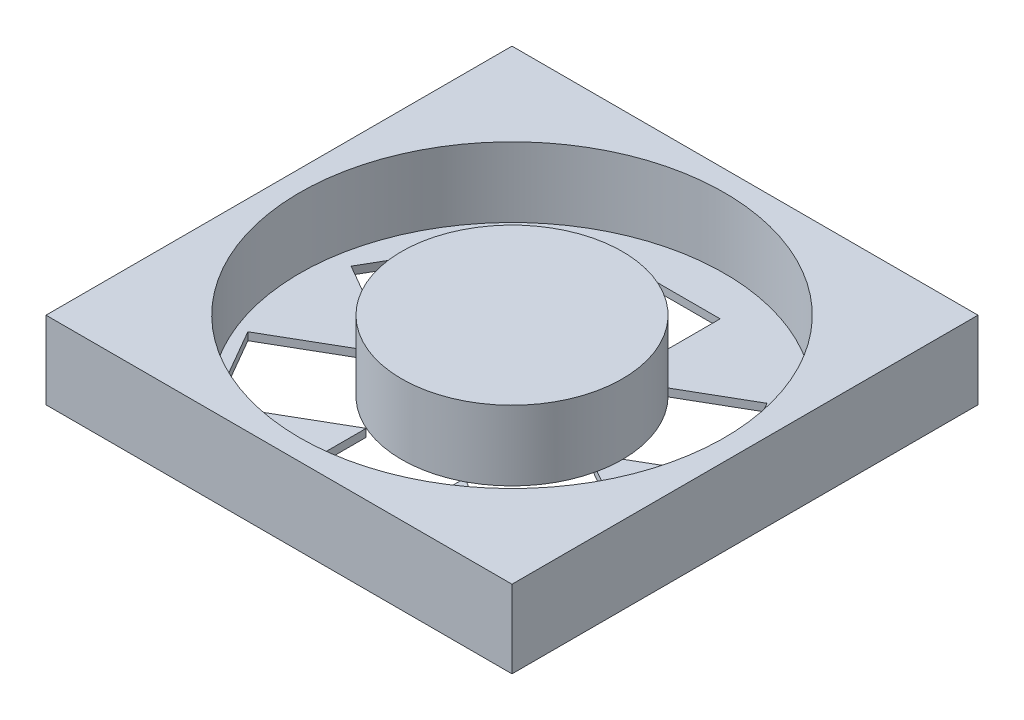
ISO-10303-21;
HEADER;
FILE_DESCRIPTION(('STEP AP214'),'2;1');
FILE_NAME('part.step','',(''),(''),'','','');
FILE_SCHEMA(('AUTOMOTIVE_DESIGN { 1 0 10303 214 1 1 1 1 }'));
ENDSEC;
DATA;
#1=APPLICATION_CONTEXT('core data for automotive mechanical design processes');
#2=APPLICATION_PROTOCOL_DEFINITION('international standard','automotive_design',2000,#1);
#3=PRODUCT_CONTEXT('',#1,'mechanical');
#4=PRODUCT('Part','Part','',(#3));
#5=PRODUCT_RELATED_PRODUCT_CATEGORY('part','',(#4));
#6=PRODUCT_DEFINITION_FORMATION('','',#4);
#7=PRODUCT_DEFINITION_CONTEXT('part definition',#1,'design');
#8=PRODUCT_DEFINITION('design','',#6,#7);
#9=PRODUCT_DEFINITION_SHAPE('','',#8);
#10=(LENGTH_UNIT() NAMED_UNIT(*) SI_UNIT(.MILLI.,.METRE.));
#11=(NAMED_UNIT(*) PLANE_ANGLE_UNIT() SI_UNIT($,.RADIAN.));
#12=(NAMED_UNIT(*) SI_UNIT($,.STERADIAN.) SOLID_ANGLE_UNIT());
#13=UNCERTAINTY_MEASURE_WITH_UNIT(LENGTH_MEASURE(1.E-05),#10,'distance_accuracy_value','');
#14=(GEOMETRIC_REPRESENTATION_CONTEXT(3) GLOBAL_UNCERTAINTY_ASSIGNED_CONTEXT((#13)) GLOBAL_UNIT_ASSIGNED_CONTEXT((#10,
#11,#12)) REPRESENTATION_CONTEXT('',''));
#15=CARTESIAN_POINT('',(0.,0.,0.));
#16=DIRECTION('',(0.,0.,1.));
#17=DIRECTION('',(1.,0.,0.));
#18=AXIS2_PLACEMENT_3D('',#15,#16,#17);
#19=CARTESIAN_POINT('',(-3.58333333333331,1.,23.));
#20=DIRECTION('',(0.,1.,0.));
#21=DIRECTION('',(0.,0.,1.));
#22=AXIS2_PLACEMENT_3D('',#19,#20,#21);
#23=PLANE('',#22);
#24=CARTESIAN_POINT('',(-3.58333333333331,1.,23.));
#25=DIRECTION('',(0.,1.,0.));
#26=DIRECTION('',(0.,0.,1.));
#27=AXIS2_PLACEMENT_3D('',#24,#25,#26);
#28=CIRCLE('',#27,27.3391290428055);
#29=CARTESIAN_POINT('',(-3.58333333333331,1.,50.3391290428055));
#30=VERTEX_POINT('',#29);
#31=EDGE_CURVE('E619',#30,#30,#28,.T.);
#32=ORIENTED_EDGE('',*,*,#31,.T.);
#33=EDGE_LOOP('',(#32));
#34=FACE_BOUND('',#33,.T.);
#35=DIRECTION('',(-0.499999999999992,0.,0.866025403784443));
#36=VECTOR('',#35,1.);
#37=CARTESIAN_POINT('',(-22.447766067007,1.,8.57036531274694));
#38=LINE('',#37,#36);
#39=CARTESIAN_POINT('',(-22.447766067007,1.,8.57036531274694));
#40=VERTEX_POINT('',#39);
#41=CARTESIAN_POINT('',(-28.4075248643401,1.,18.8929703505836));
#42=VERTEX_POINT('',#41);
#43=EDGE_CURVE('E535',#40,#42,#38,.T.);
#44=ORIENTED_EDGE('',*,*,#43,.F.);
#45=DIRECTION('',(0.866025403784443,0.,0.499999999999992));
#46=VECTOR('',#45,1.);
#47=CARTESIAN_POINT('',(-22.447766067007,1.,8.57036531274694));
#48=LINE('',#47,#46);
#49=CARTESIAN_POINT('',(-14.0674513079261,1.,13.408742294796));
#50=VERTEX_POINT('',#49);
#51=EDGE_CURVE('E545',#40,#50,#48,.T.);
#52=ORIENTED_EDGE('',*,*,#51,.T.);
#53=CARTESIAN_POINT('',(-3.58333333333331,1.,23.));
#54=DIRECTION('',(0.,1.,0.));
#55=DIRECTION('',(0.,0.,1.));
#56=AXIS2_PLACEMENT_3D('',#53,#54,#55);
#57=CIRCLE('',#56,14.2094670580151);
#58=CARTESIAN_POINT('',(-10.6904253750723,1.,10.6956025428684));
#59=VERTEX_POINT('',#58);
#60=EDGE_CURVE('E1033',#59,#50,#57,.T.);
#61=ORIENTED_EDGE('',*,*,#60,.F.);
#62=DIRECTION('',(0.,0.,1.));
#63=VECTOR('',#62,1.);
#64=CARTESIAN_POINT('',(-10.6904253750724,1.,1.00944614887827));
#65=LINE('',#64,#63);
#66=CARTESIAN_POINT('',(-10.6904253750724,1.,1.00944614887827));
#67=VERTEX_POINT('',#66);
#68=EDGE_CURVE('E568',#67,#59,#65,.T.);
#69=ORIENTED_EDGE('',*,*,#68,.F.);
#70=DIRECTION('',(-1.,0.,0.));
#71=VECTOR('',#70,1.);
#72=CARTESIAN_POINT('',(1.22909221959387,1.,1.00944614887819));
#73=LINE('',#72,#71);
#74=CARTESIAN_POINT('',(1.22909221959387,1.,1.00944614887819));
#75=VERTEX_POINT('',#74);
#76=EDGE_CURVE('E564',#75,#67,#73,.T.);
#77=ORIENTED_EDGE('',*,*,#76,.F.);
#78=DIRECTION('',(0.,0.,1.));
#79=VECTOR('',#78,1.);
#80=CARTESIAN_POINT('',(1.22909221959387,1.,1.00944614887819));
#81=LINE('',#80,#79);
#82=CARTESIAN_POINT('',(1.22909221959393,1.,9.63027620441062));
#83=VERTEX_POINT('',#82);
#84=EDGE_CURVE('E574',#75,#83,#81,.T.);
#85=ORIENTED_EDGE('',*,*,#84,.T.);
#86=CARTESIAN_POINT('',(5.53328145017321,1.,12.1006289648454));
#87=VERTEX_POINT('',#86);
#88=EDGE_CURVE('E1038',#87,#83,#57,.T.);
#89=ORIENTED_EDGE('',*,*,#88,.F.);
#90=DIRECTION('',(-0.866025403784436,0.,0.500000000000004));
#91=VECTOR('',#90,1.);
#92=CARTESIAN_POINT('',(13.6557106374321,1.,7.4111422871078));
#93=LINE('',#92,#91);
#94=CARTESIAN_POINT('',(13.6557106374321,1.,7.4111422871078));
#95=VERTEX_POINT('',#94);
#96=EDGE_CURVE('E424',#95,#87,#93,.T.);
#97=ORIENTED_EDGE('',*,*,#96,.F.);
#98=DIRECTION('',(-0.500000000000004,0.,-0.866025403784436));
#99=VECTOR('',#98,1.);
#100=CARTESIAN_POINT('',(19.6154694347652,1.,17.7337473249443));
#101=LINE('',#100,#99);
#102=CARTESIAN_POINT('',(19.6154694347652,1.,17.7337473249443));
#103=VERTEX_POINT('',#102);
#104=EDGE_CURVE('E403',#103,#95,#101,.T.);
#105=ORIENTED_EDGE('',*,*,#104,.F.);
#106=DIRECTION('',(-0.866025403784436,0.,0.500000000000004));
#107=VECTOR('',#106,1.);
#108=CARTESIAN_POINT('',(19.6154694347652,1.,17.7337473249443));
#109=LINE('',#108,#107);
#110=CARTESIAN_POINT('',(10.6259297315905,1.,22.9238604924632));
#111=VERTEX_POINT('',#110);
#112=EDGE_CURVE('E410',#103,#111,#109,.T.);
#113=ORIENTED_EDGE('',*,*,#112,.T.);
#114=CARTESIAN_POINT('',(10.3181979986245,1.,25.9421727854448));
#115=VERTEX_POINT('',#114);
#116=EDGE_CURVE('E1014',#115,#111,#57,.T.);
#117=ORIENTED_EDGE('',*,*,#116,.F.);
#118=DIRECTION('',(-0.86602540378444,0.,-0.499999999999998));
#119=VECTOR('',#118,1.);
#120=CARTESIAN_POINT('',(20.2847471606687,1.,31.6963626270426));
#121=LINE('',#120,#119);
#122=CARTESIAN_POINT('',(20.2847471606687,1.,31.6963626270426));
#123=VERTEX_POINT('',#122);
#124=EDGE_CURVE('E449',#123,#115,#121,.T.);
#125=ORIENTED_EDGE('',*,*,#124,.F.);
#126=DIRECTION('',(0.499999999999998,0.,-0.86602540378444));
#127=VECTOR('',#126,1.);
#128=CARTESIAN_POINT('',(14.3249883633356,1.,42.0189676648792));
#129=LINE('',#128,#127);
#130=CARTESIAN_POINT('',(14.3249883633356,1.,42.0189676648792));
#131=VERTEX_POINT('',#130);
#132=EDGE_CURVE('E444',#131,#123,#129,.T.);
#133=ORIENTED_EDGE('',*,*,#132,.F.);
#134=DIRECTION('',(-0.86602540378444,0.,-0.499999999999998));
#135=VECTOR('',#134,1.);
#136=CARTESIAN_POINT('',(14.3249883633356,1.,42.0189676648792));
#137=LINE('',#136,#135);
#138=CARTESIAN_POINT('',(3.10126080785786,1.,35.5389455394131));
#139=VERTEX_POINT('',#138);
#140=EDGE_CURVE('E456',#131,#139,#137,.T.);
#141=ORIENTED_EDGE('',*,*,#140,.T.);
#142=CARTESIAN_POINT('',(2.56764767140089,1.,35.8091524603392));
#143=VERTEX_POINT('',#142);
#144=EDGE_CURVE('E611',#143,#139,#57,.T.);
#145=ORIENTED_EDGE('',*,*,#144,.F.);
#146=DIRECTION('',(0.,0.,-1.));
#147=VECTOR('',#146,1.);
#148=CARTESIAN_POINT('',(2.56764767140089,1.,49.5798868287478));
#149=LINE('',#148,#147);
#150=CARTESIAN_POINT('',(2.56764767140089,1.,49.5798868287478));
#151=VERTEX_POINT('',#150);
#152=EDGE_CURVE('E481',#151,#143,#149,.T.);
#153=ORIENTED_EDGE('',*,*,#152,.F.);
#154=DIRECTION('',(1.,0.,0.));
#155=VECTOR('',#154,1.);
#156=CARTESIAN_POINT('',(-9.35186992326537,1.,49.5798868287478));
#157=LINE('',#156,#155);
#158=CARTESIAN_POINT('',(-9.35186992326537,1.,49.5798868287478));
#159=VERTEX_POINT('',#158);
#160=EDGE_CURVE('E477',#159,#151,#157,.T.);
#161=ORIENTED_EDGE('',*,*,#160,.F.);
#162=DIRECTION('',(0.,0.,-1.));
#163=VECTOR('',#162,1.);
#164=CARTESIAN_POINT('',(-9.35186992326537,1.,49.5798868287478));
#165=LINE('',#164,#163);
#166=CARTESIAN_POINT('',(-9.35186992326537,1.,36.0036792018627));
#167=VERTEX_POINT('',#166);
#168=EDGE_CURVE('E486',#159,#167,#165,.T.);
#169=ORIENTED_EDGE('',*,*,#168,.T.);
#170=DIRECTION('',(0.866025403784433,0.,-0.50000000000001));
#171=VECTOR('',#170,1.);
#172=CARTESIAN_POINT('',(-21.7784883411033,1.,43.1781906905183));
#173=LINE('',#172,#171);
#174=CARTESIAN_POINT('',(-21.7784883411033,1.,43.1781906905183));
#175=VERTEX_POINT('',#174);
#176=EDGE_CURVE('E506',#175,#167,#173,.T.);
#177=ORIENTED_EDGE('',*,*,#176,.F.);
#178=DIRECTION('',(0.50000000000001,0.,0.866025403784433));
#179=VECTOR('',#178,1.);
#180=CARTESIAN_POINT('',(-27.7382471384365,1.,32.8555856526818));
#181=LINE('',#180,#179);
#182=CARTESIAN_POINT('',(-27.7382471384365,1.,32.8555856526818));
#183=VERTEX_POINT('',#182);
#184=EDGE_CURVE('E504',#183,#175,#181,.T.);
#185=ORIENTED_EDGE('',*,*,#184,.F.);
#186=DIRECTION('',(0.866025403784433,0.,-0.50000000000001));
#187=VECTOR('',#186,1.);
#188=CARTESIAN_POINT('',(-27.7382471384365,1.,32.8555856526818));
#189=LINE('',#188,#187);
#190=CARTESIAN_POINT('',(-17.2717227885883,1.,26.812735001817));
#191=VERTEX_POINT('',#190);
#192=EDGE_CURVE('E514',#183,#191,#189,.T.);
#193=ORIENTED_EDGE('',*,*,#192,.T.);
#194=CARTESIAN_POINT('',(-17.6348831794101,1.,25.1125579272611));
#195=VERTEX_POINT('',#194);
#196=EDGE_CURVE('E1030',#195,#191,#57,.T.);
#197=ORIENTED_EDGE('',*,*,#196,.F.);
#198=DIRECTION('',(0.866025403784443,0.,0.499999999999992));
#199=VECTOR('',#198,1.);
#200=CARTESIAN_POINT('',(-28.4075248643401,1.,18.8929703505836));
#201=LINE('',#200,#199);
#202=EDGE_CURVE('E539',#42,#195,#201,.T.);
#203=ORIENTED_EDGE('',*,*,#202,.F.);
#204=EDGE_LOOP('',(#44,#52,#61,#69,#77,#85,#89,#97,#105,#113,#117,#125,#133,#141,#145,#153,#161,
#169,#177,#185,#193,#197,#203));
#205=FACE_BOUND('',#204,.T.);
#206=ADVANCED_FACE('F181',(#34,#205),#23,.T.);
#207=CARTESIAN_POINT('',(0.,0.,0.));
#208=DIRECTION('',(0.,1.,0.));
#209=DIRECTION('',(0.,0.,1.));
#210=AXIS2_PLACEMENT_3D('',#207,#208,#209);
#211=PLANE('',#210);
#212=DIRECTION('',(0.,0.,1.));
#213=VECTOR('',#212,1.);
#214=CARTESIAN_POINT('',(-33.5833333333333,0.,-7.));
#215=LINE('',#214,#213);
#216=CARTESIAN_POINT('',(-33.5833333333333,0.,-7.));
#217=VERTEX_POINT('',#216);
#218=CARTESIAN_POINT('',(-33.5833333333333,0.,53.));
#219=VERTEX_POINT('',#218);
#220=EDGE_CURVE('E622',#217,#219,#215,.T.);
#221=ORIENTED_EDGE('',*,*,#220,.F.);
#222=DIRECTION('',(-1.,0.,0.));
#223=VECTOR('',#222,1.);
#224=CARTESIAN_POINT('',(-33.5833333333333,0.,-7.));
#225=LINE('',#224,#223);
#226=CARTESIAN_POINT('',(26.4166666666667,0.,-7.));
#227=VERTEX_POINT('',#226);
#228=EDGE_CURVE('E629',#227,#217,#225,.T.);
#229=ORIENTED_EDGE('',*,*,#228,.F.);
#230=DIRECTION('',(0.,0.,-1.));
#231=VECTOR('',#230,1.);
#232=CARTESIAN_POINT('',(26.4166666666667,0.,-7.));
#233=LINE('',#232,#231);
#234=CARTESIAN_POINT('',(26.4166666666667,0.,53.));
#235=VERTEX_POINT('',#234);
#236=EDGE_CURVE('E640',#235,#227,#233,.T.);
#237=ORIENTED_EDGE('',*,*,#236,.F.);
#238=DIRECTION('',(1.,0.,0.));
#239=VECTOR('',#238,1.);
#240=CARTESIAN_POINT('',(-33.5833333333333,0.,53.));
#241=LINE('',#240,#239);
#242=EDGE_CURVE('E638',#219,#235,#241,.T.);
#243=ORIENTED_EDGE('',*,*,#242,.F.);
#244=EDGE_LOOP('',(#221,#229,#237,#243));
#245=FACE_BOUND('',#244,.T.);
#246=DIRECTION('',(-1.,0.,0.));
#247=VECTOR('',#246,1.);
#248=CARTESIAN_POINT('',(1.22909221959387,0.,1.00944614887819));
#249=LINE('',#248,#247);
#250=CARTESIAN_POINT('',(1.22909221959387,0.,1.00944614887819));
#251=VERTEX_POINT('',#250);
#252=CARTESIAN_POINT('',(-10.6904253750724,0.,1.00944614887827));
#253=VERTEX_POINT('',#252);
#254=EDGE_CURVE('E578',#251,#253,#249,.T.);
#255=ORIENTED_EDGE('',*,*,#254,.T.);
#256=DIRECTION('',(0.,0.,1.));
#257=VECTOR('',#256,1.);
#258=CARTESIAN_POINT('',(-10.6904253750724,0.,1.00944614887827));
#259=LINE('',#258,#257);
#260=CARTESIAN_POINT('',(-10.6904253750723,0.,15.3584691261895));
#261=VERTEX_POINT('',#260);
#262=EDGE_CURVE('E581',#253,#261,#259,.T.);
#263=ORIENTED_EDGE('',*,*,#262,.T.);
#264=DIRECTION('',(0.866025403784443,0.,0.499999999999992));
#265=VECTOR('',#264,1.);
#266=CARTESIAN_POINT('',(-22.447766067007,0.,8.57036531274694));
#267=LINE('',#266,#265);
#268=CARTESIAN_POINT('',(-22.447766067007,0.,8.57036531274694));
#269=VERTEX_POINT('',#268);
#270=EDGE_CURVE('E538',#269,#261,#267,.T.);
#271=ORIENTED_EDGE('',*,*,#270,.F.);
#272=DIRECTION('',(-0.499999999999992,0.,0.866025403784443));
#273=VECTOR('',#272,1.);
#274=CARTESIAN_POINT('',(-22.447766067007,0.,8.57036531274694));
#275=LINE('',#274,#273);
#276=CARTESIAN_POINT('',(-28.4075248643401,0.,18.8929703505836));
#277=VERTEX_POINT('',#276);
#278=EDGE_CURVE('E549',#269,#277,#275,.T.);
#279=ORIENTED_EDGE('',*,*,#278,.T.);
#280=DIRECTION('',(0.866025403784443,0.,0.499999999999992));
#281=VECTOR('',#280,1.);
#282=CARTESIAN_POINT('',(-28.4075248643401,0.,18.8929703505836));
#283=LINE('',#282,#281);
#284=CARTESIAN_POINT('',(-15.9809064465019,0.,26.0674818392391));
#285=VERTEX_POINT('',#284);
#286=EDGE_CURVE('E552',#277,#285,#283,.T.);
#287=ORIENTED_EDGE('',*,*,#286,.T.);
#288=DIRECTION('',(0.866025403784433,0.,-0.50000000000001));
#289=VECTOR('',#288,1.);
#290=CARTESIAN_POINT('',(-27.7382471384365,0.,32.8555856526818));
#291=LINE('',#290,#289);
#292=CARTESIAN_POINT('',(-27.7382471384365,0.,32.8555856526818));
#293=VERTEX_POINT('',#292);
#294=EDGE_CURVE('E507',#293,#285,#291,.T.);
#295=ORIENTED_EDGE('',*,*,#294,.F.);
#296=DIRECTION('',(0.50000000000001,0.,0.866025403784433));
#297=VECTOR('',#296,1.);
#298=CARTESIAN_POINT('',(-27.7382471384365,0.,32.8555856526818));
#299=LINE('',#298,#297);
#300=CARTESIAN_POINT('',(-21.7784883411033,0.,43.1781906905183));
#301=VERTEX_POINT('',#300);
#302=EDGE_CURVE('E518',#293,#301,#299,.T.);
#303=ORIENTED_EDGE('',*,*,#302,.T.);
#304=DIRECTION('',(0.866025403784433,0.,-0.50000000000001));
#305=VECTOR('',#304,1.);
#306=CARTESIAN_POINT('',(-21.7784883411033,0.,43.1781906905183));
#307=LINE('',#306,#305);
#308=CARTESIAN_POINT('',(-9.35186992326537,0.,36.0036792018627));
#309=VERTEX_POINT('',#308);
#310=EDGE_CURVE('E521',#301,#309,#307,.T.);
#311=ORIENTED_EDGE('',*,*,#310,.T.);
#312=DIRECTION('',(0.,0.,-1.));
#313=VECTOR('',#312,1.);
#314=CARTESIAN_POINT('',(-9.35186992326537,0.,49.5798868287478));
#315=LINE('',#314,#313);
#316=CARTESIAN_POINT('',(-9.35186992326537,0.,49.5798868287478));
#317=VERTEX_POINT('',#316);
#318=EDGE_CURVE('E480',#317,#309,#315,.T.);
#319=ORIENTED_EDGE('',*,*,#318,.F.);
#320=DIRECTION('',(1.,0.,0.));
#321=VECTOR('',#320,1.);
#322=CARTESIAN_POINT('',(-9.35186992326537,0.,49.5798868287478));
#323=LINE('',#322,#321);
#324=CARTESIAN_POINT('',(2.56764767140089,0.,49.5798868287478));
#325=VERTEX_POINT('',#324);
#326=EDGE_CURVE('E490',#317,#325,#323,.T.);
#327=ORIENTED_EDGE('',*,*,#326,.T.);
#328=DIRECTION('',(0.,0.,-1.));
#329=VECTOR('',#328,1.);
#330=CARTESIAN_POINT('',(2.56764767140089,0.,49.5798868287478));
#331=LINE('',#330,#329);
#332=CARTESIAN_POINT('',(2.56764767140089,0.,35.2308638514366));
#333=VERTEX_POINT('',#332);
#334=EDGE_CURVE('E493',#325,#333,#331,.T.);
#335=ORIENTED_EDGE('',*,*,#334,.T.);
#336=DIRECTION('',(-0.86602540378444,0.,-0.499999999999998));
#337=VECTOR('',#336,1.);
#338=CARTESIAN_POINT('',(14.3249883633356,0.,42.0189676648792));
#339=LINE('',#338,#337);
#340=CARTESIAN_POINT('',(14.3249883633356,0.,42.0189676648792));
#341=VERTEX_POINT('',#340);
#342=EDGE_CURVE('E448',#341,#333,#339,.T.);
#343=ORIENTED_EDGE('',*,*,#342,.F.);
#344=DIRECTION('',(0.499999999999998,0.,-0.86602540378444));
#345=VECTOR('',#344,1.);
#346=CARTESIAN_POINT('',(14.3249883633356,0.,42.0189676648792));
#347=LINE('',#346,#345);
#348=CARTESIAN_POINT('',(20.2847471606687,0.,31.6963626270426));
#349=VERTEX_POINT('',#348);
#350=EDGE_CURVE('E460',#341,#349,#347,.T.);
#351=ORIENTED_EDGE('',*,*,#350,.T.);
#352=DIRECTION('',(-0.86602540378444,0.,-0.499999999999998));
#353=VECTOR('',#352,1.);
#354=CARTESIAN_POINT('',(20.2847471606687,0.,31.6963626270426));
#355=LINE('',#354,#353);
#356=CARTESIAN_POINT('',(7.85812874283057,0.,24.521851138387));
#357=VERTEX_POINT('',#356);
#358=EDGE_CURVE('E463',#349,#357,#355,.T.);
#359=ORIENTED_EDGE('',*,*,#358,.T.);
#360=DIRECTION('',(-0.866025403784436,0.,0.500000000000004));
#361=VECTOR('',#360,1.);
#362=CARTESIAN_POINT('',(19.6154694347652,0.,17.7337473249443));
#363=LINE('',#362,#361);
#364=CARTESIAN_POINT('',(19.6154694347652,0.,17.7337473249443));
#365=VERTEX_POINT('',#364);
#366=EDGE_CURVE('E426',#365,#357,#363,.T.);
#367=ORIENTED_EDGE('',*,*,#366,.F.);
#368=DIRECTION('',(-0.500000000000004,0.,-0.866025403784436));
#369=VECTOR('',#368,1.);
#370=CARTESIAN_POINT('',(19.6154694347652,0.,17.7337473249443));
#371=LINE('',#370,#369);
#372=CARTESIAN_POINT('',(13.6557106374321,0.,7.4111422871078));
#373=VERTEX_POINT('',#372);
#374=EDGE_CURVE('E406',#365,#373,#371,.T.);
#375=ORIENTED_EDGE('',*,*,#374,.T.);
#376=DIRECTION('',(-0.866025403784436,0.,0.500000000000004));
#377=VECTOR('',#376,1.);
#378=CARTESIAN_POINT('',(13.6557106374321,0.,7.4111422871078));
#379=LINE('',#378,#377);
#380=CARTESIAN_POINT('',(1.22909221959397,0.,14.5856537757635));
#381=VERTEX_POINT('',#380);
#382=EDGE_CURVE('E436',#373,#381,#379,.T.);
#383=ORIENTED_EDGE('',*,*,#382,.T.);
#384=DIRECTION('',(0.,0.,1.));
#385=VECTOR('',#384,1.);
#386=CARTESIAN_POINT('',(1.22909221959387,0.,1.00944614887819));
#387=LINE('',#386,#385);
#388=EDGE_CURVE('E567',#251,#381,#387,.T.);
#389=ORIENTED_EDGE('',*,*,#388,.F.);
#390=EDGE_LOOP('',(#255,#263,#271,#279,#287,#295,#303,#311,#319,#327,#335,#343,#351,#359,#367,
#375,#383,#389));
#391=FACE_BOUND('',#390,.T.);
#392=ADVANCED_FACE('F658',(#245,#391),#211,.F.);
#393=CARTESIAN_POINT('',(-33.5833333333333,10.,-7.));
#394=DIRECTION('',(1.,0.,0.));
#395=DIRECTION('',(0.,0.,-1.));
#396=AXIS2_PLACEMENT_3D('',#393,#394,#395);
#397=PLANE('',#396);
#398=ORIENTED_EDGE('',*,*,#220,.T.);
#399=DIRECTION('',(0.,-1.,0.));
#400=VECTOR('',#399,1.);
#401=CARTESIAN_POINT('',(-33.5833333333333,10.,53.));
#402=LINE('',#401,#400);
#403=CARTESIAN_POINT('',(-33.5833333333333,10.,53.));
#404=VERTEX_POINT('',#403);
#405=EDGE_CURVE('E12',#404,#219,#402,.T.);
#406=ORIENTED_EDGE('',*,*,#405,.F.);
#407=DIRECTION('',(0.,0.,1.));
#408=VECTOR('',#407,1.);
#409=CARTESIAN_POINT('',(-33.5833333333333,10.,-7.));
#410=LINE('',#409,#408);
#411=CARTESIAN_POINT('',(-33.5833333333333,10.,-7.));
#412=VERTEX_POINT('',#411);
#413=EDGE_CURVE('E625',#412,#404,#410,.T.);
#414=ORIENTED_EDGE('',*,*,#413,.F.);
#415=DIRECTION('',(0.,-1.,0.));
#416=VECTOR('',#415,1.);
#417=CARTESIAN_POINT('',(-33.5833333333333,10.,-7.));
#418=LINE('',#417,#416);
#419=EDGE_CURVE('E635',#412,#217,#418,.T.);
#420=ORIENTED_EDGE('',*,*,#419,.T.);
#421=EDGE_LOOP('',(#398,#406,#414,#420));
#422=FACE_BOUND('',#421,.T.);
#423=ADVANCED_FACE('F183',(#422),#397,.F.);
#424=CARTESIAN_POINT('',(-33.5833333333333,10.,53.));
#425=DIRECTION('',(0.,0.,-1.));
#426=DIRECTION('',(-1.,0.,0.));
#427=AXIS2_PLACEMENT_3D('',#424,#425,#426);
#428=PLANE('',#427);
#429=ORIENTED_EDGE('',*,*,#242,.T.);
#430=DIRECTION('',(0.,-1.,0.));
#431=VECTOR('',#430,1.);
#432=CARTESIAN_POINT('',(26.4166666666667,10.,53.));
#433=LINE('',#432,#431);
#434=CARTESIAN_POINT('',(26.4166666666667,10.,53.));
#435=VERTEX_POINT('',#434);
#436=EDGE_CURVE('E189',#435,#235,#433,.T.);
#437=ORIENTED_EDGE('',*,*,#436,.F.);
#438=DIRECTION('',(1.,0.,0.));
#439=VECTOR('',#438,1.);
#440=CARTESIAN_POINT('',(-33.5833333333333,10.,53.));
#441=LINE('',#440,#439);
#442=EDGE_CURVE('E628',#404,#435,#441,.T.);
#443=ORIENTED_EDGE('',*,*,#442,.F.);
#444=ORIENTED_EDGE('',*,*,#405,.T.);
#445=EDGE_LOOP('',(#429,#437,#443,#444));
#446=FACE_BOUND('',#445,.T.);
#447=ADVANCED_FACE('F669',(#446),#428,.F.);
#448=CARTESIAN_POINT('',(26.4166666666667,10.,-7.));
#449=DIRECTION('',(-1.,0.,0.));
#450=DIRECTION('',(0.,0.,1.));
#451=AXIS2_PLACEMENT_3D('',#448,#449,#450);
#452=PLANE('',#451);
#453=ORIENTED_EDGE('',*,*,#236,.T.);
#454=DIRECTION('',(0.,-1.,0.));
#455=VECTOR('',#454,1.);
#456=CARTESIAN_POINT('',(26.4166666666667,10.,-7.));
#457=LINE('',#456,#455);
#458=CARTESIAN_POINT('',(26.4166666666667,10.,-7.));
#459=VERTEX_POINT('',#458);
#460=EDGE_CURVE('E645',#459,#227,#457,.T.);
#461=ORIENTED_EDGE('',*,*,#460,.F.);
#462=DIRECTION('',(0.,0.,-1.));
#463=VECTOR('',#462,1.);
#464=CARTESIAN_POINT('',(26.4166666666667,10.,-7.));
#465=LINE('',#464,#463);
#466=EDGE_CURVE('E631',#435,#459,#465,.T.);
#467=ORIENTED_EDGE('',*,*,#466,.F.);
#468=ORIENTED_EDGE('',*,*,#436,.T.);
#469=EDGE_LOOP('',(#453,#461,#467,#468));
#470=FACE_BOUND('',#469,.T.);
#471=ADVANCED_FACE('F652',(#470),#452,.F.);
#472=CARTESIAN_POINT('',(-33.5833333333333,10.,-7.));
#473=DIRECTION('',(0.,0.,1.));
#474=DIRECTION('',(1.,0.,0.));
#475=AXIS2_PLACEMENT_3D('',#472,#473,#474);
#476=PLANE('',#475);
#477=ORIENTED_EDGE('',*,*,#228,.T.);
#478=ORIENTED_EDGE('',*,*,#419,.F.);
#479=DIRECTION('',(-1.,0.,0.));
#480=VECTOR('',#479,1.);
#481=CARTESIAN_POINT('',(-33.5833333333333,10.,-7.));
#482=LINE('',#481,#480);
#483=EDGE_CURVE('E633',#459,#412,#482,.T.);
#484=ORIENTED_EDGE('',*,*,#483,.F.);
#485=ORIENTED_EDGE('',*,*,#460,.T.);
#486=EDGE_LOOP('',(#477,#478,#484,#485));
#487=FACE_BOUND('',#486,.T.);
#488=ADVANCED_FACE('F662',(#487),#476,.F.);
#489=CARTESIAN_POINT('',(0.,10.,0.));
#490=DIRECTION('',(0.,1.,0.));
#491=DIRECTION('',(0.,0.,1.));
#492=AXIS2_PLACEMENT_3D('',#489,#490,#491);
#493=PLANE('',#492);
#494=CARTESIAN_POINT('',(-3.58333333333331,10.,23.));
#495=DIRECTION('',(0.,1.,0.));
#496=DIRECTION('',(0.,0.,1.));
#497=AXIS2_PLACEMENT_3D('',#494,#495,#496);
#498=CIRCLE('',#497,27.3391290428055);
#499=CARTESIAN_POINT('',(-3.58333333333331,10.,50.3391290428055));
#500=VERTEX_POINT('',#499);
#501=EDGE_CURVE('E614',#500,#500,#498,.T.);
#502=ORIENTED_EDGE('',*,*,#501,.F.);
#503=EDGE_LOOP('',(#502));
#504=FACE_BOUND('',#503,.T.);
#505=ORIENTED_EDGE('',*,*,#413,.T.);
#506=ORIENTED_EDGE('',*,*,#442,.T.);
#507=ORIENTED_EDGE('',*,*,#466,.T.);
#508=ORIENTED_EDGE('',*,*,#483,.T.);
#509=EDGE_LOOP('',(#505,#506,#507,#508));
#510=FACE_BOUND('',#509,.T.);
#511=ADVANCED_FACE('F668',(#504,#510),#493,.T.);
#512=CARTESIAN_POINT('',(-3.58333333333331,1.,23.));
#513=DIRECTION('',(0.,1.,0.));
#514=DIRECTION('',(0.,0.,1.));
#515=AXIS2_PLACEMENT_3D('',#512,#513,#514);
#516=CYLINDRICAL_SURFACE('',#515,27.3391290428055);
#517=ORIENTED_EDGE('',*,*,#31,.F.);
#518=EDGE_LOOP('',(#517));
#519=FACE_BOUND('',#518,.T.);
#520=ORIENTED_EDGE('',*,*,#501,.T.);
#521=EDGE_LOOP('',(#520));
#522=FACE_BOUND('',#521,.T.);
#523=ADVANCED_FACE('F688',(#519,#522),#516,.F.);
#524=CARTESIAN_POINT('',(-3.58333333333331,1.,23.));
#525=DIRECTION('',(0.,1.,0.));
#526=DIRECTION('',(0.,0.,1.));
#527=AXIS2_PLACEMENT_3D('',#524,#525,#526);
#528=CYLINDRICAL_SURFACE('',#527,14.2094670580151);
#529=ORIENTED_EDGE('',*,*,#144,.T.);
#530=EDGE_CURVE('E615',#139,#115,#57,.T.);
#531=ORIENTED_EDGE('',*,*,#530,.T.);
#532=ORIENTED_EDGE('',*,*,#116,.T.);
#533=EDGE_CURVE('E1017',#111,#87,#57,.T.);
#534=ORIENTED_EDGE('',*,*,#533,.T.);
#535=ORIENTED_EDGE('',*,*,#88,.T.);
#536=EDGE_CURVE('E1035',#83,#59,#57,.T.);
#537=ORIENTED_EDGE('',*,*,#536,.T.);
#538=ORIENTED_EDGE('',*,*,#60,.T.);
#539=EDGE_CURVE('E1032',#50,#195,#57,.T.);
#540=ORIENTED_EDGE('',*,*,#539,.T.);
#541=ORIENTED_EDGE('',*,*,#196,.T.);
#542=EDGE_CURVE('E616',#191,#143,#57,.T.);
#543=ORIENTED_EDGE('',*,*,#542,.T.);
#544=EDGE_LOOP('',(#529,#531,#532,#534,#535,#537,#538,#540,#541,#543));
#545=FACE_BOUND('',#544,.T.);
#546=CARTESIAN_POINT('',(-3.58333333333331,10.,23.));
#547=DIRECTION('',(0.,1.,0.));
#548=DIRECTION('',(0.,0.,1.));
#549=AXIS2_PLACEMENT_3D('',#546,#547,#548);
#550=CIRCLE('',#549,14.2094670580151);
#551=CARTESIAN_POINT('',(-3.58333333333331,10.,37.2094670580151));
#552=VERTEX_POINT('',#551);
#553=EDGE_CURVE('E607',#552,#552,#550,.T.);
#554=ORIENTED_EDGE('',*,*,#553,.F.);
#555=EDGE_LOOP('',(#554));
#556=FACE_BOUND('',#555,.T.);
#557=ADVANCED_FACE('F686',(#545,#556),#528,.T.);
#558=ORIENTED_EDGE('',*,*,#553,.T.);
#559=EDGE_LOOP('',(#558));
#560=FACE_BOUND('',#559,.T.);
#561=ADVANCED_FACE('F694',(#560),#493,.T.);
#562=CARTESIAN_POINT('',(0.,1.,0.));
#563=DIRECTION('',(0.,1.,0.));
#564=DIRECTION('',(0.,0.,1.));
#565=AXIS2_PLACEMENT_3D('',#562,#563,#564);
#566=PLANE('',#565);
#567=DIRECTION('',(-0.499999999999992,0.,0.866025403784443));
#568=VECTOR('',#567,1.);
#569=CARTESIAN_POINT('',(-7.54347002307182,1.,17.1753646457946));
#570=LINE('',#569,#568);
#571=CARTESIAN_POINT('',(-8.14626998980301,1.,18.2194448149739));
#572=VERTEX_POINT('',#571);
#573=CARTESIAN_POINT('',(-12.2311511277702,1.,25.2946664888131));
#574=VERTEX_POINT('',#573);
#575=EDGE_CURVE('E541',#572,#574,#570,.T.);
#576=ORIENTED_EDGE('',*,*,#575,.T.);
#577=DIRECTION('',(0.50000000000001,0.,0.866025403784433));
#578=VECTOR('',#577,1.);
#579=CARTESIAN_POINT('',(-12.8339510945015,1.,24.2505863196338));
#580=LINE('',#579,#578);
#581=CARTESIAN_POINT('',(-8.1462699898029,1.,32.3698881626521));
#582=VERTEX_POINT('',#581);
#583=EDGE_CURVE('E510',#574,#582,#580,.T.);
#584=ORIENTED_EDGE('',*,*,#583,.T.);
#585=DIRECTION('',(1.,0.,0.));
#586=VECTOR('',#585,1.);
#587=CARTESIAN_POINT('',(-9.35186992326537,1.,32.3698881626521));
#588=LINE('',#587,#586);
#589=CARTESIAN_POINT('',(0.0234922861316353,1.,32.3698881626521));
#590=VERTEX_POINT('',#589);
#591=EDGE_CURVE('E483',#582,#590,#588,.T.);
#592=ORIENTED_EDGE('',*,*,#591,.T.);
#593=DIRECTION('',(0.499999999999998,0.,-0.86602540378444));
#594=VECTOR('',#593,1.);
#595=CARTESIAN_POINT('',(-0.579307680599564,1.,33.4139683318314));
#596=LINE('',#595,#594);
#597=CARTESIAN_POINT('',(4.10837342409892,1.,25.294666488813));
#598=VERTEX_POINT('',#597);
#599=EDGE_CURVE('E452',#590,#598,#596,.T.);
#600=ORIENTED_EDGE('',*,*,#599,.T.);
#601=DIRECTION('',(-0.500000000000004,0.,-0.866025403784436));
#602=VECTOR('',#601,1.);
#603=CARTESIAN_POINT('',(4.71117339083012,1.,26.3387466579922));
#604=LINE('',#603,#602);
#605=CARTESIAN_POINT('',(0.0234922861315897,1.,18.2194448149739));
#606=VERTEX_POINT('',#605);
#607=EDGE_CURVE('E432',#598,#606,#604,.T.);
#608=ORIENTED_EDGE('',*,*,#607,.T.);
#609=DIRECTION('',(-1.,0.,0.));
#610=VECTOR('',#609,1.);
#611=CARTESIAN_POINT('',(1.22909221959399,1.,18.2194448149739));
#612=LINE('',#611,#610);
#613=EDGE_CURVE('E571',#606,#572,#612,.T.);
#614=ORIENTED_EDGE('',*,*,#613,.T.);
#615=EDGE_LOOP('',(#576,#584,#592,#600,#608,#614));
#616=FACE_BOUND('',#615,.T.);
#617=CARTESIAN_POINT('',(2.56764767140089,1.,35.2308638514366));
#618=VERTEX_POINT('',#617);
#619=EDGE_CURVE('E455',#139,#618,#137,.T.);
#620=ORIENTED_EDGE('',*,*,#619,.T.);
#621=EDGE_CURVE('E479',#143,#618,#149,.T.);
#622=ORIENTED_EDGE('',*,*,#621,.F.);
#623=ORIENTED_EDGE('',*,*,#542,.F.);
#624=CARTESIAN_POINT('',(-15.9809064465019,1.,26.0674818392391));
#625=VERTEX_POINT('',#624);
#626=EDGE_CURVE('E513',#191,#625,#189,.T.);
#627=ORIENTED_EDGE('',*,*,#626,.T.);
#628=EDGE_CURVE('E537',#195,#625,#201,.T.);
#629=ORIENTED_EDGE('',*,*,#628,.F.);
#630=ORIENTED_EDGE('',*,*,#539,.F.);
#631=CARTESIAN_POINT('',(-10.6904253750723,1.,15.3584691261895));
#632=VERTEX_POINT('',#631);
#633=EDGE_CURVE('E544',#50,#632,#48,.T.);
#634=ORIENTED_EDGE('',*,*,#633,.T.);
#635=EDGE_CURVE('E566',#59,#632,#65,.T.);
#636=ORIENTED_EDGE('',*,*,#635,.F.);
#637=ORIENTED_EDGE('',*,*,#536,.F.);
#638=CARTESIAN_POINT('',(1.22909221959397,1.,14.5856537757635));
#639=VERTEX_POINT('',#638);
#640=EDGE_CURVE('E573',#83,#639,#81,.T.);
#641=ORIENTED_EDGE('',*,*,#640,.T.);
#642=EDGE_CURVE('E425',#87,#639,#93,.T.);
#643=ORIENTED_EDGE('',*,*,#642,.F.);
#644=ORIENTED_EDGE('',*,*,#533,.F.);
#645=CARTESIAN_POINT('',(7.85812874283057,1.,24.521851138387));
#646=VERTEX_POINT('',#645);
#647=EDGE_CURVE('E416',#111,#646,#109,.T.);
#648=ORIENTED_EDGE('',*,*,#647,.T.);
#649=EDGE_CURVE('E447',#115,#646,#121,.T.);
#650=ORIENTED_EDGE('',*,*,#649,.F.);
#651=ORIENTED_EDGE('',*,*,#530,.F.);
#652=EDGE_LOOP('',(#620,#622,#623,#627,#629,#630,#634,#636,#637,#641,#643,#644,#648,#650,#651));
#653=FACE_BOUND('',#652,.T.);
#654=ADVANCED_FACE('F726',(#616,#653),#566,.F.);
#655=CARTESIAN_POINT('',(19.6154694347652,1.,17.7337473249443));
#656=DIRECTION('',(0.500000000000004,0.,0.866025403784436));
#657=DIRECTION('',(0.866025403784436,0.,-0.500000000000004));
#658=AXIS2_PLACEMENT_3D('',#655,#656,#657);
#659=PLANE('',#658);
#660=ORIENTED_EDGE('',*,*,#112,.F.);
#661=DIRECTION('',(0.,-1.,0.));
#662=VECTOR('',#661,1.);
#663=CARTESIAN_POINT('',(19.6154694347652,1.,17.7337473249443));
#664=LINE('',#663,#662);
#665=EDGE_CURVE('E398',#103,#365,#664,.T.);
#666=ORIENTED_EDGE('',*,*,#665,.T.);
#667=ORIENTED_EDGE('',*,*,#366,.T.);
#668=DIRECTION('',(0.,-1.,0.));
#669=VECTOR('',#668,1.);
#670=CARTESIAN_POINT('',(7.85812874283056,1.,24.521851138387));
#671=LINE('',#670,#669);
#672=EDGE_CURVE('E443',#646,#357,#671,.T.);
#673=ORIENTED_EDGE('',*,*,#672,.F.);
#674=ORIENTED_EDGE('',*,*,#647,.F.);
#675=EDGE_LOOP('',(#660,#666,#667,#673,#674));
#676=FACE_BOUND('',#675,.T.);
#677=ADVANCED_FACE('F414',(#676),#659,.F.);
#678=CARTESIAN_POINT('',(19.6154694347652,1.,17.7337473249443));
#679=DIRECTION('',(-0.866025403784436,0.,0.500000000000004));
#680=DIRECTION('',(0.500000000000004,0.,0.866025403784436));
#681=AXIS2_PLACEMENT_3D('',#678,#679,#680);
#682=PLANE('',#681);
#683=ORIENTED_EDGE('',*,*,#374,.F.);
#684=ORIENTED_EDGE('',*,*,#665,.F.);
#685=ORIENTED_EDGE('',*,*,#104,.T.);
#686=DIRECTION('',(0.,-1.,0.));
#687=VECTOR('',#686,1.);
#688=CARTESIAN_POINT('',(13.6557106374321,1.,7.4111422871078));
#689=LINE('',#688,#687);
#690=EDGE_CURVE('E409',#95,#373,#689,.T.);
#691=ORIENTED_EDGE('',*,*,#690,.T.);
#692=EDGE_LOOP('',(#683,#684,#685,#691));
#693=FACE_BOUND('',#692,.T.);
#694=ADVANCED_FACE('F400',(#693),#682,.T.);
#695=CARTESIAN_POINT('',(13.6557106374321,1.,7.4111422871078));
#696=DIRECTION('',(0.500000000000004,0.,0.866025403784436));
#697=DIRECTION('',(0.866025403784436,0.,-0.500000000000004));
#698=AXIS2_PLACEMENT_3D('',#695,#696,#697);
#699=PLANE('',#698);
#700=ORIENTED_EDGE('',*,*,#382,.F.);
#701=ORIENTED_EDGE('',*,*,#690,.F.);
#702=ORIENTED_EDGE('',*,*,#96,.T.);
#703=ORIENTED_EDGE('',*,*,#642,.T.);
#704=DIRECTION('',(0.,1.,0.));
#705=VECTOR('',#704,1.);
#706=CARTESIAN_POINT('',(1.22909221959397,1.,14.5856537757635));
#707=LINE('',#706,#705);
#708=EDGE_CURVE('E604',#381,#639,#707,.T.);
#709=ORIENTED_EDGE('',*,*,#708,.F.);
#710=EDGE_LOOP('',(#700,#701,#702,#703,#709));
#711=FACE_BOUND('',#710,.T.);
#712=ADVANCED_FACE('F745',(#711),#699,.T.);
#713=CARTESIAN_POINT('',(4.71117339083012,1.,26.3387466579922));
#714=DIRECTION('',(-0.866025403784436,0.,0.500000000000004));
#715=DIRECTION('',(0.500000000000004,0.,0.866025403784437));
#716=AXIS2_PLACEMENT_3D('',#713,#714,#715);
#717=PLANE('',#716);
#718=DIRECTION('',(0.,-1.,0.));
#719=VECTOR('',#718,1.);
#720=CARTESIAN_POINT('',(4.10837342409892,1.,25.294666488813));
#721=LINE('',#720,#719);
#722=CARTESIAN_POINT('',(4.10837342409892,0.,25.294666488813));
#723=VERTEX_POINT('',#722);
#724=EDGE_CURVE('E603',#598,#723,#721,.T.);
#725=ORIENTED_EDGE('',*,*,#724,.T.);
#726=DIRECTION('',(-0.500000000000004,0.,-0.866025403784436));
#727=VECTOR('',#726,1.);
#728=CARTESIAN_POINT('',(4.71117339083012,0.,26.3387466579922));
#729=LINE('',#728,#727);
#730=CARTESIAN_POINT('',(0.0234922861315897,0.,18.2194448149739));
#731=VERTEX_POINT('',#730);
#732=EDGE_CURVE('E429',#723,#731,#729,.T.);
#733=ORIENTED_EDGE('',*,*,#732,.T.);
#734=DIRECTION('',(0.,1.,0.));
#735=VECTOR('',#734,1.);
#736=CARTESIAN_POINT('',(0.0234922861315906,1.,18.2194448149739));
#737=LINE('',#736,#735);
#738=EDGE_CURVE('E601',#731,#606,#737,.T.);
#739=ORIENTED_EDGE('',*,*,#738,.T.);
#740=ORIENTED_EDGE('',*,*,#607,.F.);
#741=EDGE_LOOP('',(#725,#733,#739,#740));
#742=FACE_BOUND('',#741,.T.);
#743=ADVANCED_FACE('F752',(#742),#717,.F.);
#744=CARTESIAN_POINT('',(-27.7382471384365,1.,32.8555856526818));
#745=DIRECTION('',(0.866025403784433,0.,-0.50000000000001));
#746=DIRECTION('',(-0.50000000000001,0.,-0.866025403784433));
#747=AXIS2_PLACEMENT_3D('',#744,#745,#746);
#748=PLANE('',#747);
#749=ORIENTED_EDGE('',*,*,#302,.F.);
#750=DIRECTION('',(0.,-1.,0.));
#751=VECTOR('',#750,1.);
#752=CARTESIAN_POINT('',(-27.7382471384365,1.,32.8555856526818));
#753=LINE('',#752,#751);
#754=EDGE_CURVE('E517',#183,#293,#753,.T.);
#755=ORIENTED_EDGE('',*,*,#754,.F.);
#756=ORIENTED_EDGE('',*,*,#184,.T.);
#757=DIRECTION('',(0.,-1.,0.));
#758=VECTOR('',#757,1.);
#759=CARTESIAN_POINT('',(-21.7784883411033,1.,43.1781906905183));
#760=LINE('',#759,#758);
#761=EDGE_CURVE('E531',#175,#301,#760,.T.);
#762=ORIENTED_EDGE('',*,*,#761,.T.);
#763=EDGE_LOOP('',(#749,#755,#756,#762));
#764=FACE_BOUND('',#763,.T.);
#765=ADVANCED_FACE('F760',(#764),#748,.T.);
#766=CARTESIAN_POINT('',(-21.7784883411033,1.,43.1781906905183));
#767=DIRECTION('',(-0.50000000000001,0.,-0.866025403784433));
#768=DIRECTION('',(-0.866025403784433,0.,0.50000000000001));
#769=AXIS2_PLACEMENT_3D('',#766,#767,#768);
#770=PLANE('',#769);
#771=DIRECTION('',(0.,-1.,0.));
#772=VECTOR('',#771,1.);
#773=CARTESIAN_POINT('',(-9.35186992326537,1.,36.0036792018627));
#774=LINE('',#773,#772);
#775=EDGE_CURVE('E503',#167,#309,#774,.T.);
#776=ORIENTED_EDGE('',*,*,#775,.T.);
#777=ORIENTED_EDGE('',*,*,#310,.F.);
#778=ORIENTED_EDGE('',*,*,#761,.F.);
#779=ORIENTED_EDGE('',*,*,#176,.T.);
#780=EDGE_LOOP('',(#776,#777,#778,#779));
#781=FACE_BOUND('',#780,.T.);
#782=ADVANCED_FACE('F768',(#781),#770,.T.);
#783=CARTESIAN_POINT('',(-27.7382471384365,1.,32.8555856526818));
#784=DIRECTION('',(-0.50000000000001,0.,-0.866025403784433));
#785=DIRECTION('',(-0.866025403784433,0.,0.50000000000001));
#786=AXIS2_PLACEMENT_3D('',#783,#784,#785);
#787=PLANE('',#786);
#788=ORIENTED_EDGE('',*,*,#192,.F.);
#789=ORIENTED_EDGE('',*,*,#754,.T.);
#790=ORIENTED_EDGE('',*,*,#294,.T.);
#791=DIRECTION('',(0.,-1.,0.));
#792=VECTOR('',#791,1.);
#793=CARTESIAN_POINT('',(-15.9809064465019,1.,26.0674818392391));
#794=LINE('',#793,#792);
#795=EDGE_CURVE('E534',#625,#285,#794,.T.);
#796=ORIENTED_EDGE('',*,*,#795,.F.);
#797=ORIENTED_EDGE('',*,*,#626,.F.);
#798=EDGE_LOOP('',(#788,#789,#790,#796,#797));
#799=FACE_BOUND('',#798,.T.);
#800=ADVANCED_FACE('F776',(#799),#787,.F.);
#801=CARTESIAN_POINT('',(-9.35186992326537,1.,49.5798868287478));
#802=DIRECTION('',(-1.,0.,0.));
#803=DIRECTION('',(0.,0.,1.));
#804=AXIS2_PLACEMENT_3D('',#801,#802,#803);
#805=PLANE('',#804);
#806=ORIENTED_EDGE('',*,*,#168,.F.);
#807=DIRECTION('',(0.,-1.,0.));
#808=VECTOR('',#807,1.);
#809=CARTESIAN_POINT('',(-9.35186992326537,1.,49.5798868287478));
#810=LINE('',#809,#808);
#811=EDGE_CURVE('E489',#159,#317,#810,.T.);
#812=ORIENTED_EDGE('',*,*,#811,.T.);
#813=ORIENTED_EDGE('',*,*,#318,.T.);
#814=ORIENTED_EDGE('',*,*,#775,.F.);
#815=EDGE_LOOP('',(#806,#812,#813,#814));
#816=FACE_BOUND('',#815,.T.);
#817=ADVANCED_FACE('F784',(#816),#805,.F.);
#818=CARTESIAN_POINT('',(-9.35186992326537,1.,49.5798868287478));
#819=DIRECTION('',(0.,0.,-1.));
#820=DIRECTION('',(-1.,0.,0.));
#821=AXIS2_PLACEMENT_3D('',#818,#819,#820);
#822=PLANE('',#821);
#823=ORIENTED_EDGE('',*,*,#326,.F.);
#824=ORIENTED_EDGE('',*,*,#811,.F.);
#825=ORIENTED_EDGE('',*,*,#160,.T.);
#826=DIRECTION('',(0.,-1.,0.));
#827=VECTOR('',#826,1.);
#828=CARTESIAN_POINT('',(2.56764767140089,1.,49.5798868287478));
#829=LINE('',#828,#827);
#830=EDGE_CURVE('E204',#151,#325,#829,.T.);
#831=ORIENTED_EDGE('',*,*,#830,.T.);
#832=EDGE_LOOP('',(#823,#824,#825,#831));
#833=FACE_BOUND('',#832,.T.);
#834=ADVANCED_FACE('F792',(#833),#822,.T.);
#835=CARTESIAN_POINT('',(-22.447766067007,1.,8.57036531274694));
#836=DIRECTION('',(0.866025403784443,0.,0.499999999999992));
#837=DIRECTION('',(0.499999999999992,0.,-0.866025403784443));
#838=AXIS2_PLACEMENT_3D('',#835,#836,#837);
#839=PLANE('',#838);
#840=ORIENTED_EDGE('',*,*,#278,.F.);
#841=DIRECTION('',(0.,-1.,0.));
#842=VECTOR('',#841,1.);
#843=CARTESIAN_POINT('',(-22.447766067007,1.,8.57036531274694));
#844=LINE('',#843,#842);
#845=EDGE_CURVE('E548',#40,#269,#844,.T.);
#846=ORIENTED_EDGE('',*,*,#845,.F.);
#847=ORIENTED_EDGE('',*,*,#43,.T.);
#848=DIRECTION('',(0.,-1.,0.));
#849=VECTOR('',#848,1.);
#850=CARTESIAN_POINT('',(-28.4075248643401,1.,18.8929703505836));
#851=LINE('',#850,#849);
#852=EDGE_CURVE('E196',#42,#277,#851,.T.);
#853=ORIENTED_EDGE('',*,*,#852,.T.);
#854=EDGE_LOOP('',(#840,#846,#847,#853));
#855=FACE_BOUND('',#854,.T.);
#856=ADVANCED_FACE('F800',(#855),#839,.T.);
#857=CARTESIAN_POINT('',(-28.4075248643401,1.,18.8929703505836));
#858=DIRECTION('',(0.499999999999992,0.,-0.866025403784443));
#859=DIRECTION('',(-0.866025403784443,0.,-0.499999999999992));
#860=AXIS2_PLACEMENT_3D('',#857,#858,#859);
#861=PLANE('',#860);
#862=ORIENTED_EDGE('',*,*,#795,.T.);
#863=ORIENTED_EDGE('',*,*,#286,.F.);
#864=ORIENTED_EDGE('',*,*,#852,.F.);
#865=ORIENTED_EDGE('',*,*,#202,.T.);
#866=ORIENTED_EDGE('',*,*,#628,.T.);
#867=EDGE_LOOP('',(#862,#863,#864,#865,#866));
#868=FACE_BOUND('',#867,.T.);
#869=ADVANCED_FACE('F808',(#868),#861,.T.);
#870=CARTESIAN_POINT('',(-12.8339510945015,1.,24.2505863196338));
#871=DIRECTION('',(0.866025403784433,0.,-0.50000000000001));
#872=DIRECTION('',(-0.50000000000001,0.,-0.866025403784433));
#873=AXIS2_PLACEMENT_3D('',#870,#871,#872);
#874=PLANE('',#873);
#875=ORIENTED_EDGE('',*,*,#583,.F.);
#876=DIRECTION('',(0.,-1.,0.));
#877=VECTOR('',#876,1.);
#878=CARTESIAN_POINT('',(-12.2311511277702,1.,25.2946664888131));
#879=LINE('',#878,#877);
#880=CARTESIAN_POINT('',(-12.2311511277702,0.,25.2946664888131));
#881=VERTEX_POINT('',#880);
#882=EDGE_CURVE('E494',#574,#881,#879,.T.);
#883=ORIENTED_EDGE('',*,*,#882,.T.);
#884=DIRECTION('',(0.50000000000001,0.,0.866025403784433));
#885=VECTOR('',#884,1.);
#886=CARTESIAN_POINT('',(-12.8339510945015,0.,24.2505863196338));
#887=LINE('',#886,#885);
#888=CARTESIAN_POINT('',(-8.1462699898029,0.,32.3698881626521));
#889=VERTEX_POINT('',#888);
#890=EDGE_CURVE('E525',#881,#889,#887,.T.);
#891=ORIENTED_EDGE('',*,*,#890,.T.);
#892=DIRECTION('',(0.,-1.,0.));
#893=VECTOR('',#892,1.);
#894=CARTESIAN_POINT('',(-8.1462699898029,1.,32.3698881626521));
#895=LINE('',#894,#893);
#896=EDGE_CURVE('E464',#582,#889,#895,.T.);
#897=ORIENTED_EDGE('',*,*,#896,.F.);
#898=EDGE_LOOP('',(#875,#883,#891,#897));
#899=FACE_BOUND('',#898,.T.);
#900=ADVANCED_FACE('F816',(#899),#874,.F.);
#901=CARTESIAN_POINT('',(-22.447766067007,1.,8.57036531274694));
#902=DIRECTION('',(0.499999999999992,0.,-0.866025403784443));
#903=DIRECTION('',(-0.866025403784443,0.,-0.499999999999992));
#904=AXIS2_PLACEMENT_3D('',#901,#902,#903);
#905=PLANE('',#904);
#906=ORIENTED_EDGE('',*,*,#51,.F.);
#907=ORIENTED_EDGE('',*,*,#845,.T.);
#908=ORIENTED_EDGE('',*,*,#270,.T.);
#909=DIRECTION('',(0.,-1.,0.));
#910=VECTOR('',#909,1.);
#911=CARTESIAN_POINT('',(-10.6904253750723,1.,15.3584691261895));
#912=LINE('',#911,#910);
#913=EDGE_CURVE('E563',#632,#261,#912,.T.);
#914=ORIENTED_EDGE('',*,*,#913,.F.);
#915=ORIENTED_EDGE('',*,*,#633,.F.);
#916=EDGE_LOOP('',(#906,#907,#908,#914,#915));
#917=FACE_BOUND('',#916,.T.);
#918=ADVANCED_FACE('F823',(#917),#905,.F.);
#919=CARTESIAN_POINT('',(-7.54347002307182,1.,17.1753646457946));
#920=DIRECTION('',(0.866025403784443,0.,0.499999999999992));
#921=DIRECTION('',(0.499999999999992,0.,-0.866025403784443));
#922=AXIS2_PLACEMENT_3D('',#919,#920,#921);
#923=PLANE('',#922);
#924=ORIENTED_EDGE('',*,*,#575,.F.);
#925=DIRECTION('',(0.,-1.,0.));
#926=VECTOR('',#925,1.);
#927=CARTESIAN_POINT('',(-8.14626998980301,1.,18.2194448149739));
#928=LINE('',#927,#926);
#929=CARTESIAN_POINT('',(-8.14626998980301,0.,18.2194448149739));
#930=VERTEX_POINT('',#929);
#931=EDGE_CURVE('E522',#572,#930,#928,.T.);
#932=ORIENTED_EDGE('',*,*,#931,.T.);
#933=DIRECTION('',(-0.499999999999992,0.,0.866025403784443));
#934=VECTOR('',#933,1.);
#935=CARTESIAN_POINT('',(-7.54347002307182,0.,17.1753646457946));
#936=LINE('',#935,#934);
#937=EDGE_CURVE('E556',#930,#881,#936,.T.);
#938=ORIENTED_EDGE('',*,*,#937,.T.);
#939=ORIENTED_EDGE('',*,*,#882,.F.);
#940=EDGE_LOOP('',(#924,#932,#938,#939));
#941=FACE_BOUND('',#940,.T.);
#942=ADVANCED_FACE('F831',(#941),#923,.F.);
#943=CARTESIAN_POINT('',(1.22909221959387,1.,1.00944614887819));
#944=DIRECTION('',(1.,0.,0.));
#945=DIRECTION('',(0.,0.,-1.));
#946=AXIS2_PLACEMENT_3D('',#943,#944,#945);
#947=PLANE('',#946);
#948=ORIENTED_EDGE('',*,*,#708,.T.);
#949=ORIENTED_EDGE('',*,*,#640,.F.);
#950=ORIENTED_EDGE('',*,*,#84,.F.);
#951=DIRECTION('',(0.,-1.,0.));
#952=VECTOR('',#951,1.);
#953=CARTESIAN_POINT('',(1.22909221959387,1.,1.00944614887819));
#954=LINE('',#953,#952);
#955=EDGE_CURVE('E577',#75,#251,#954,.T.);
#956=ORIENTED_EDGE('',*,*,#955,.T.);
#957=ORIENTED_EDGE('',*,*,#388,.T.);
#958=EDGE_LOOP('',(#948,#949,#950,#956,#957));
#959=FACE_BOUND('',#958,.T.);
#960=ADVANCED_FACE('F839',(#959),#947,.F.);
#961=CARTESIAN_POINT('',(1.22909221959387,1.,1.00944614887819));
#962=DIRECTION('',(0.,0.,1.));
#963=DIRECTION('',(1.,0.,0.));
#964=AXIS2_PLACEMENT_3D('',#961,#962,#963);
#965=PLANE('',#964);
#966=ORIENTED_EDGE('',*,*,#254,.F.);
#967=ORIENTED_EDGE('',*,*,#955,.F.);
#968=ORIENTED_EDGE('',*,*,#76,.T.);
#969=DIRECTION('',(0.,-1.,0.));
#970=VECTOR('',#969,1.);
#971=CARTESIAN_POINT('',(-10.6904253750724,1.,1.00944614887827));
#972=LINE('',#971,#970);
#973=EDGE_CURVE('E553',#67,#253,#972,.T.);
#974=ORIENTED_EDGE('',*,*,#973,.T.);
#975=EDGE_LOOP('',(#966,#967,#968,#974));
#976=FACE_BOUND('',#975,.T.);
#977=ADVANCED_FACE('F847',(#976),#965,.T.);
#978=CARTESIAN_POINT('',(-10.6904253750724,1.,1.00944614887827));
#979=DIRECTION('',(1.,0.,0.));
#980=DIRECTION('',(0.,0.,-1.));
#981=AXIS2_PLACEMENT_3D('',#978,#979,#980);
#982=PLANE('',#981);
#983=ORIENTED_EDGE('',*,*,#913,.T.);
#984=ORIENTED_EDGE('',*,*,#262,.F.);
#985=ORIENTED_EDGE('',*,*,#973,.F.);
#986=ORIENTED_EDGE('',*,*,#68,.T.);
#987=ORIENTED_EDGE('',*,*,#635,.T.);
#988=EDGE_LOOP('',(#983,#984,#985,#986,#987));
#989=FACE_BOUND('',#988,.T.);
#990=ADVANCED_FACE('F855',(#989),#982,.T.);
#991=CARTESIAN_POINT('',(1.22909221959399,1.,18.2194448149739));
#992=DIRECTION('',(0.,0.,1.));
#993=DIRECTION('',(1.,0.,0.));
#994=AXIS2_PLACEMENT_3D('',#991,#992,#993);
#995=PLANE('',#994);
#996=DIRECTION('',(-1.,0.,0.));
#997=VECTOR('',#996,1.);
#998=CARTESIAN_POINT('',(1.22909221959399,0.,18.2194448149739));
#999=LINE('',#998,#997);
#1000=EDGE_CURVE('E584',#731,#930,#999,.T.);
#1001=ORIENTED_EDGE('',*,*,#1000,.T.);
#1002=ORIENTED_EDGE('',*,*,#931,.F.);
#1003=ORIENTED_EDGE('',*,*,#613,.F.);
#1004=ORIENTED_EDGE('',*,*,#738,.F.);
#1005=EDGE_LOOP('',(#1001,#1002,#1003,#1004));
#1006=FACE_BOUND('',#1005,.T.);
#1007=ADVANCED_FACE('F862',(#1006),#995,.F.);
#1008=CARTESIAN_POINT('',(2.56764767140089,1.,49.5798868287478));
#1009=DIRECTION('',(-1.,0.,0.));
#1010=DIRECTION('',(0.,0.,1.));
#1011=AXIS2_PLACEMENT_3D('',#1008,#1009,#1010);
#1012=PLANE('',#1011);
#1013=DIRECTION('',(0.,-1.,0.));
#1014=VECTOR('',#1013,1.);
#1015=CARTESIAN_POINT('',(2.56764767140089,1.,35.2308638514366));
#1016=LINE('',#1015,#1014);
#1017=EDGE_CURVE('E476',#618,#333,#1016,.T.);
#1018=ORIENTED_EDGE('',*,*,#1017,.T.);
#1019=ORIENTED_EDGE('',*,*,#334,.F.);
#1020=ORIENTED_EDGE('',*,*,#830,.F.);
#1021=ORIENTED_EDGE('',*,*,#152,.T.);
#1022=ORIENTED_EDGE('',*,*,#621,.T.);
#1023=EDGE_LOOP('',(#1018,#1019,#1020,#1021,#1022));
#1024=FACE_BOUND('',#1023,.T.);
#1025=ADVANCED_FACE('F870',(#1024),#1012,.T.);
#1026=CARTESIAN_POINT('',(-9.35186992326537,1.,32.3698881626521));
#1027=DIRECTION('',(0.,0.,-1.));
#1028=DIRECTION('',(-1.,0.,0.));
#1029=AXIS2_PLACEMENT_3D('',#1026,#1027,#1028);
#1030=PLANE('',#1029);
#1031=ORIENTED_EDGE('',*,*,#591,.F.);
#1032=ORIENTED_EDGE('',*,*,#896,.T.);
#1033=DIRECTION('',(1.,0.,0.));
#1034=VECTOR('',#1033,1.);
#1035=CARTESIAN_POINT('',(-9.35186992326537,0.,32.3698881626521));
#1036=LINE('',#1035,#1034);
#1037=CARTESIAN_POINT('',(0.023492286131634,0.,32.3698881626521));
#1038=VERTEX_POINT('',#1037);
#1039=EDGE_CURVE('E497',#889,#1038,#1036,.T.);
#1040=ORIENTED_EDGE('',*,*,#1039,.T.);
#1041=DIRECTION('',(0.,-1.,0.));
#1042=VECTOR('',#1041,1.);
#1043=CARTESIAN_POINT('',(0.0234922861316351,1.,32.3698881626521));
#1044=LINE('',#1043,#1042);
#1045=EDGE_CURVE('E437',#590,#1038,#1044,.T.);
#1046=ORIENTED_EDGE('',*,*,#1045,.F.);
#1047=EDGE_LOOP('',(#1031,#1032,#1040,#1046));
#1048=FACE_BOUND('',#1047,.T.);
#1049=ADVANCED_FACE('F878',(#1048),#1030,.F.);
#1050=CARTESIAN_POINT('',(-0.579307680599564,1.,33.4139683318314));
#1051=DIRECTION('',(-0.86602540378444,0.,-0.499999999999998));
#1052=DIRECTION('',(-0.499999999999998,0.,0.86602540378444));
#1053=AXIS2_PLACEMENT_3D('',#1050,#1051,#1052);
#1054=PLANE('',#1053);
#1055=ORIENTED_EDGE('',*,*,#599,.F.);
#1056=ORIENTED_EDGE('',*,*,#1045,.T.);
#1057=DIRECTION('',(0.499999999999998,0.,-0.86602540378444));
#1058=VECTOR('',#1057,1.);
#1059=CARTESIAN_POINT('',(-0.579307680599564,0.,33.4139683318314));
#1060=LINE('',#1059,#1058);
#1061=EDGE_CURVE('E467',#1038,#723,#1060,.T.);
#1062=ORIENTED_EDGE('',*,*,#1061,.T.);
#1063=ORIENTED_EDGE('',*,*,#724,.F.);
#1064=EDGE_LOOP('',(#1055,#1056,#1062,#1063));
#1065=FACE_BOUND('',#1064,.T.);
#1066=ADVANCED_FACE('F885',(#1065),#1054,.F.);
#1067=CARTESIAN_POINT('',(14.3249883633356,1.,42.0189676648792));
#1068=DIRECTION('',(-0.499999999999998,0.,0.86602540378444));
#1069=DIRECTION('',(0.86602540378444,0.,0.499999999999998));
#1070=AXIS2_PLACEMENT_3D('',#1067,#1068,#1069);
#1071=PLANE('',#1070);
#1072=ORIENTED_EDGE('',*,*,#140,.F.);
#1073=DIRECTION('',(0.,-1.,0.));
#1074=VECTOR('',#1073,1.);
#1075=CARTESIAN_POINT('',(14.3249883633356,1.,42.0189676648792));
#1076=LINE('',#1075,#1074);
#1077=EDGE_CURVE('E459',#131,#341,#1076,.T.);
#1078=ORIENTED_EDGE('',*,*,#1077,.T.);
#1079=ORIENTED_EDGE('',*,*,#342,.T.);
#1080=ORIENTED_EDGE('',*,*,#1017,.F.);
#1081=ORIENTED_EDGE('',*,*,#619,.F.);
#1082=EDGE_LOOP('',(#1072,#1078,#1079,#1080,#1081));
#1083=FACE_BOUND('',#1082,.T.);
#1084=ADVANCED_FACE('F893',(#1083),#1071,.F.);
#1085=CARTESIAN_POINT('',(14.3249883633356,1.,42.0189676648792));
#1086=DIRECTION('',(-0.86602540378444,0.,-0.499999999999998));
#1087=DIRECTION('',(-0.499999999999998,0.,0.86602540378444));
#1088=AXIS2_PLACEMENT_3D('',#1085,#1086,#1087);
#1089=PLANE('',#1088);
#1090=ORIENTED_EDGE('',*,*,#350,.F.);
#1091=ORIENTED_EDGE('',*,*,#1077,.F.);
#1092=ORIENTED_EDGE('',*,*,#132,.T.);
#1093=DIRECTION('',(0.,-1.,0.));
#1094=VECTOR('',#1093,1.);
#1095=CARTESIAN_POINT('',(20.2847471606687,1.,31.6963626270426));
#1096=LINE('',#1095,#1094);
#1097=EDGE_CURVE('E473',#123,#349,#1096,.T.);
#1098=ORIENTED_EDGE('',*,*,#1097,.T.);
#1099=EDGE_LOOP('',(#1090,#1091,#1092,#1098));
#1100=FACE_BOUND('',#1099,.T.);
#1101=ADVANCED_FACE('F901',(#1100),#1089,.T.);
#1102=CARTESIAN_POINT('',(20.2847471606687,1.,31.6963626270426));
#1103=DIRECTION('',(-0.499999999999998,0.,0.86602540378444));
#1104=DIRECTION('',(0.86602540378444,0.,0.499999999999998));
#1105=AXIS2_PLACEMENT_3D('',#1102,#1103,#1104);
#1106=PLANE('',#1105);
#1107=ORIENTED_EDGE('',*,*,#672,.T.);
#1108=ORIENTED_EDGE('',*,*,#358,.F.);
#1109=ORIENTED_EDGE('',*,*,#1097,.F.);
#1110=ORIENTED_EDGE('',*,*,#124,.T.);
#1111=ORIENTED_EDGE('',*,*,#649,.T.);
#1112=EDGE_LOOP('',(#1107,#1108,#1109,#1110,#1111));
#1113=FACE_BOUND('',#1112,.T.);
#1114=ADVANCED_FACE('F697',(#1113),#1106,.T.);
#1115=ORIENTED_EDGE('',*,*,#890,.F.);
#1116=ORIENTED_EDGE('',*,*,#937,.F.);
#1117=ORIENTED_EDGE('',*,*,#1000,.F.);
#1118=ORIENTED_EDGE('',*,*,#732,.F.);
#1119=ORIENTED_EDGE('',*,*,#1061,.F.);
#1120=ORIENTED_EDGE('',*,*,#1039,.F.);
#1121=EDGE_LOOP('',(#1115,#1116,#1117,#1118,#1119,#1120));
#1122=FACE_BOUND('',#1121,.T.);
#1123=ADVANCED_FACE('F683',(#1122),#211,.F.);
#1124=CLOSED_SHELL('',(#206,#392,#423,#447,#471,#488,#511,#523,#557,#561,#654,#677,#694,#712,
#743,#765,#782,#800,#817,#834,#856,#869,#900,#918,#942,#960,#977,#990,#1007,#1025,#1049,#1066,
#1084,#1101,#1114,#1123));
#1125=MANIFOLD_SOLID_BREP('B2',#1124);
#1126=ADVANCED_BREP_SHAPE_REPRESENTATION('',(#18,#1125),#14);
#1127=SHAPE_DEFINITION_REPRESENTATION(#9,#1126);
ENDSEC;
END-ISO-10303-21;
